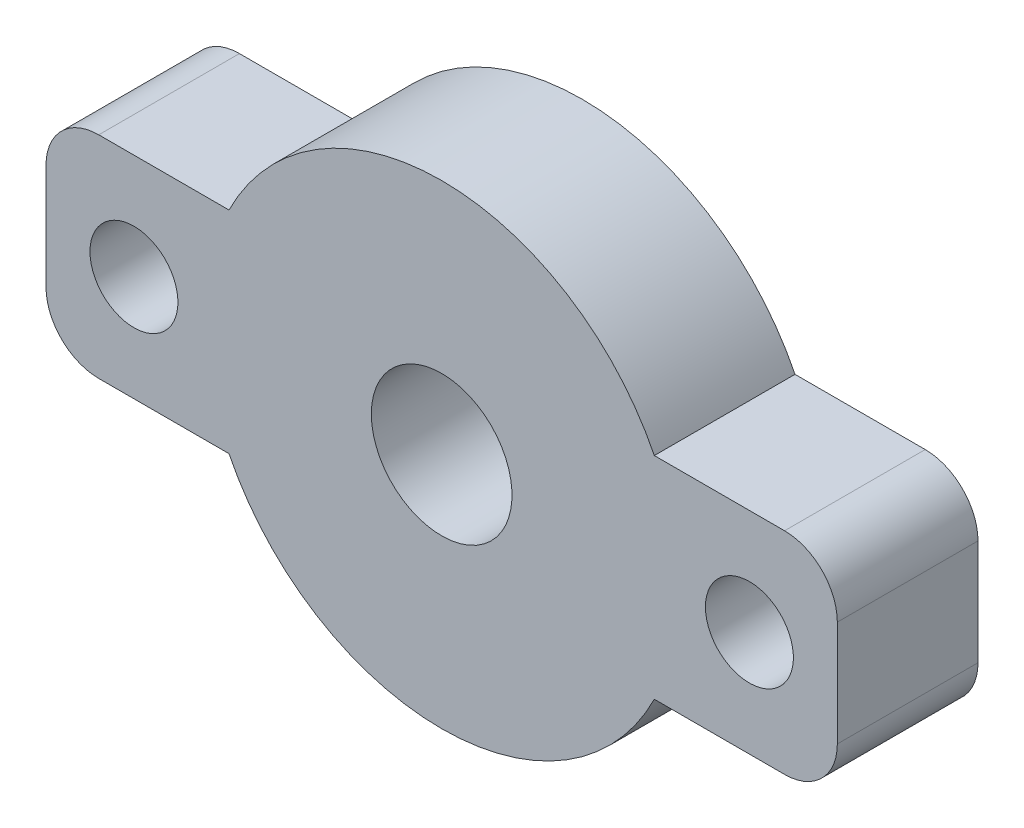
ISO-10303-21;
HEADER;
FILE_DESCRIPTION(('STEP AP214'),'2;1');
FILE_NAME('part.step','',(''),(''),'','','');
FILE_SCHEMA(('AUTOMOTIVE_DESIGN { 1 0 10303 214 1 1 1 1 }'));
ENDSEC;
DATA;
#1=APPLICATION_CONTEXT('core data for automotive mechanical design processes');
#2=APPLICATION_PROTOCOL_DEFINITION('international standard','automotive_design',2000,#1);
#3=PRODUCT_CONTEXT('',#1,'mechanical');
#4=PRODUCT('Part','Part','',(#3));
#5=PRODUCT_RELATED_PRODUCT_CATEGORY('part','',(#4));
#6=PRODUCT_DEFINITION_FORMATION('','',#4);
#7=PRODUCT_DEFINITION_CONTEXT('part definition',#1,'design');
#8=PRODUCT_DEFINITION('design','',#6,#7);
#9=PRODUCT_DEFINITION_SHAPE('','',#8);
#10=(LENGTH_UNIT() NAMED_UNIT(*) SI_UNIT(.MILLI.,.METRE.));
#11=(NAMED_UNIT(*) PLANE_ANGLE_UNIT() SI_UNIT($,.RADIAN.));
#12=(NAMED_UNIT(*) SI_UNIT($,.STERADIAN.) SOLID_ANGLE_UNIT());
#13=UNCERTAINTY_MEASURE_WITH_UNIT(LENGTH_MEASURE(1.E-05),#10,'distance_accuracy_value','');
#14=(GEOMETRIC_REPRESENTATION_CONTEXT(3) GLOBAL_UNCERTAINTY_ASSIGNED_CONTEXT((#13)) GLOBAL_UNIT_ASSIGNED_CONTEXT((#10,
#11,#12)) REPRESENTATION_CONTEXT('',''));
#15=CARTESIAN_POINT('',(0.,0.,0.));
#16=DIRECTION('',(0.,0.,1.));
#17=DIRECTION('',(1.,0.,0.));
#18=AXIS2_PLACEMENT_3D('',#15,#16,#17);
#19=CARTESIAN_POINT('',(0.,0.,8.));
#20=DIRECTION('',(0.,0.,-1.));
#21=DIRECTION('',(-1.,0.,0.));
#22=AXIS2_PLACEMENT_3D('',#19,#20,#21);
#23=CYLINDRICAL_SURFACE('',#22,13.5);
#24=CARTESIAN_POINT('',(0.,0.,8.));
#25=DIRECTION('',(0.,0.,1.));
#26=DIRECTION('',(1.,0.,0.));
#27=AXIS2_PLACEMENT_3D('',#24,#25,#26);
#28=CIRCLE('',#27,13.5);
#29=CARTESIAN_POINT('',(12.0933866224478,6.,8.));
#30=VERTEX_POINT('',#29);
#31=CARTESIAN_POINT('',(-12.0933866224478,6.,8.));
#32=VERTEX_POINT('',#31);
#33=EDGE_CURVE('E160',#30,#32,#28,.T.);
#34=ORIENTED_EDGE('',*,*,#33,.F.);
#35=DIRECTION('',(0.,0.,-1.));
#36=VECTOR('',#35,1.);
#37=CARTESIAN_POINT('',(12.0933866224478,6.,8.));
#38=LINE('',#37,#36);
#39=CARTESIAN_POINT('',(12.0933866224478,6.,0.));
#40=VERTEX_POINT('',#39);
#41=EDGE_CURVE('E131',#30,#40,#38,.T.);
#42=ORIENTED_EDGE('',*,*,#41,.T.);
#43=CARTESIAN_POINT('',(0.,0.,0.));
#44=DIRECTION('',(0.,0.,1.));
#45=DIRECTION('',(1.,0.,0.));
#46=AXIS2_PLACEMENT_3D('',#43,#44,#45);
#47=CIRCLE('',#46,13.5);
#48=CARTESIAN_POINT('',(-12.0933866224478,6.,0.));
#49=VERTEX_POINT('',#48);
#50=EDGE_CURVE('E130',#40,#49,#47,.T.);
#51=ORIENTED_EDGE('',*,*,#50,.T.);
#52=DIRECTION('',(0.,0.,-1.));
#53=VECTOR('',#52,1.);
#54=CARTESIAN_POINT('',(-12.0933866224478,6.,8.));
#55=LINE('',#54,#53);
#56=EDGE_CURVE('E141',#49,#32,#55,.F.);
#57=ORIENTED_EDGE('',*,*,#56,.T.);
#58=EDGE_LOOP('',(#34,#42,#51,#57));
#59=FACE_BOUND('',#58,.T.);
#60=ADVANCED_FACE('F33',(#59),#23,.T.);
#61=CARTESIAN_POINT('',(-12.0933866224478,-6.,8.));
#62=VERTEX_POINT('',#61);
#63=CARTESIAN_POINT('',(12.0933866224478,-6.,8.));
#64=VERTEX_POINT('',#63);
#65=EDGE_CURVE('E138',#62,#64,#28,.T.);
#66=ORIENTED_EDGE('',*,*,#65,.F.);
#67=DIRECTION('',(0.,0.,-1.));
#68=VECTOR('',#67,1.);
#69=CARTESIAN_POINT('',(-12.0933866224478,-6.,8.));
#70=LINE('',#69,#68);
#71=CARTESIAN_POINT('',(-12.0933866224478,-6.,0.));
#72=VERTEX_POINT('',#71);
#73=EDGE_CURVE('E135',#62,#72,#70,.T.);
#74=ORIENTED_EDGE('',*,*,#73,.T.);
#75=CARTESIAN_POINT('',(12.0933866224478,-6.,0.));
#76=VERTEX_POINT('',#75);
#77=EDGE_CURVE('E121',#72,#76,#47,.T.);
#78=ORIENTED_EDGE('',*,*,#77,.T.);
#79=DIRECTION('',(0.,0.,-1.));
#80=VECTOR('',#79,1.);
#81=CARTESIAN_POINT('',(12.0933866224478,-6.,8.));
#82=LINE('',#81,#80);
#83=EDGE_CURVE('E142',#76,#64,#82,.F.);
#84=ORIENTED_EDGE('',*,*,#83,.T.);
#85=EDGE_LOOP('',(#66,#74,#78,#84));
#86=FACE_BOUND('',#85,.T.);
#87=ADVANCED_FACE('F136',(#86),#23,.T.);
#88=CARTESIAN_POINT('',(0.,0.,8.));
#89=DIRECTION('',(0.,0.,1.));
#90=DIRECTION('',(1.,0.,0.));
#91=AXIS2_PLACEMENT_3D('',#88,#89,#90);
#92=PLANE('',#91);
#93=CARTESIAN_POINT('',(17.5,0.,8.));
#94=DIRECTION('',(0.,0.,-1.));
#95=DIRECTION('',(-1.,0.,0.));
#96=AXIS2_PLACEMENT_3D('',#93,#94,#95);
#97=CIRCLE('',#96,2.5);
#98=CARTESIAN_POINT('',(15.,0.,8.));
#99=VERTEX_POINT('',#98);
#100=EDGE_CURVE('E220',#99,#99,#97,.T.);
#101=ORIENTED_EDGE('',*,*,#100,.T.);
#102=EDGE_LOOP('',(#101));
#103=FACE_BOUND('',#102,.T.);
#104=CARTESIAN_POINT('',(-17.5,0.,8.));
#105=DIRECTION('',(0.,0.,-1.));
#106=DIRECTION('',(-1.,0.,0.));
#107=AXIS2_PLACEMENT_3D('',#104,#105,#106);
#108=CIRCLE('',#107,2.5);
#109=CARTESIAN_POINT('',(-20.,0.,8.));
#110=VERTEX_POINT('',#109);
#111=EDGE_CURVE('E226',#110,#110,#108,.T.);
#112=ORIENTED_EDGE('',*,*,#111,.T.);
#113=EDGE_LOOP('',(#112));
#114=FACE_BOUND('',#113,.T.);
#115=CARTESIAN_POINT('',(0.,0.,8.));
#116=DIRECTION('',(0.,0.,-1.));
#117=DIRECTION('',(-1.,0.,0.));
#118=AXIS2_PLACEMENT_3D('',#115,#116,#117);
#119=CIRCLE('',#118,4.);
#120=CARTESIAN_POINT('',(-4.,0.,8.));
#121=VERTEX_POINT('',#120);
#122=EDGE_CURVE('E212',#121,#121,#119,.T.);
#123=ORIENTED_EDGE('',*,*,#122,.T.);
#124=EDGE_LOOP('',(#123));
#125=FACE_BOUND('',#124,.T.);
#126=DIRECTION('',(0.,-1.,0.));
#127=VECTOR('',#126,1.);
#128=CARTESIAN_POINT('',(-22.5,-6.,8.));
#129=LINE('',#128,#127);
#130=CARTESIAN_POINT('',(-22.5,3.,8.));
#131=VERTEX_POINT('',#130);
#132=CARTESIAN_POINT('',(-22.5,-3.,8.));
#133=VERTEX_POINT('',#132);
#134=EDGE_CURVE('E211',#131,#133,#129,.T.);
#135=ORIENTED_EDGE('',*,*,#134,.T.);
#136=CARTESIAN_POINT('',(-19.5,-3.,8.));
#137=DIRECTION('',(0.,0.,1.));
#138=DIRECTION('',(1.,0.,0.));
#139=AXIS2_PLACEMENT_3D('',#136,#137,#138);
#140=CIRCLE('',#139,3.);
#141=CARTESIAN_POINT('',(-19.5,-6.,8.));
#142=VERTEX_POINT('',#141);
#143=EDGE_CURVE('E175',#133,#142,#140,.T.);
#144=ORIENTED_EDGE('',*,*,#143,.T.);
#145=DIRECTION('',(1.,0.,0.));
#146=VECTOR('',#145,1.);
#147=CARTESIAN_POINT('',(22.5,-6.,8.));
#148=LINE('',#147,#146);
#149=EDGE_CURVE('E206',#142,#62,#148,.T.);
#150=ORIENTED_EDGE('',*,*,#149,.T.);
#151=ORIENTED_EDGE('',*,*,#65,.T.);
#152=CARTESIAN_POINT('',(19.5,-6.,8.));
#153=VERTEX_POINT('',#152);
#154=EDGE_CURVE('E208',#64,#153,#148,.T.);
#155=ORIENTED_EDGE('',*,*,#154,.T.);
#156=CARTESIAN_POINT('',(19.5,-3.,8.));
#157=DIRECTION('',(0.,0.,1.));
#158=DIRECTION('',(1.,0.,0.));
#159=AXIS2_PLACEMENT_3D('',#156,#157,#158);
#160=CIRCLE('',#159,3.);
#161=CARTESIAN_POINT('',(22.5,-3.,8.));
#162=VERTEX_POINT('',#161);
#163=EDGE_CURVE('E171',#153,#162,#160,.T.);
#164=ORIENTED_EDGE('',*,*,#163,.T.);
#165=DIRECTION('',(0.,1.,0.));
#166=VECTOR('',#165,1.);
#167=CARTESIAN_POINT('',(22.5,-6.,8.));
#168=LINE('',#167,#166);
#169=CARTESIAN_POINT('',(22.5,3.,8.));
#170=VERTEX_POINT('',#169);
#171=EDGE_CURVE('E196',#162,#170,#168,.T.);
#172=ORIENTED_EDGE('',*,*,#171,.T.);
#173=CARTESIAN_POINT('',(19.5,3.,8.));
#174=DIRECTION('',(0.,0.,1.));
#175=DIRECTION('',(1.,0.,0.));
#176=AXIS2_PLACEMENT_3D('',#173,#174,#175);
#177=CIRCLE('',#176,3.);
#178=CARTESIAN_POINT('',(19.5,6.,8.));
#179=VERTEX_POINT('',#178);
#180=EDGE_CURVE('E169',#170,#179,#177,.T.);
#181=ORIENTED_EDGE('',*,*,#180,.T.);
#182=DIRECTION('',(-1.,0.,0.));
#183=VECTOR('',#182,1.);
#184=CARTESIAN_POINT('',(22.5,6.,8.));
#185=LINE('',#184,#183);
#186=EDGE_CURVE('E154',#179,#30,#185,.T.);
#187=ORIENTED_EDGE('',*,*,#186,.T.);
#188=ORIENTED_EDGE('',*,*,#33,.T.);
#189=CARTESIAN_POINT('',(-19.5,6.,8.));
#190=VERTEX_POINT('',#189);
#191=EDGE_CURVE('E205',#32,#190,#185,.T.);
#192=ORIENTED_EDGE('',*,*,#191,.T.);
#193=CARTESIAN_POINT('',(-19.5,3.,8.));
#194=DIRECTION('',(0.,0.,1.));
#195=DIRECTION('',(1.,0.,0.));
#196=AXIS2_PLACEMENT_3D('',#193,#194,#195);
#197=CIRCLE('',#196,3.);
#198=EDGE_CURVE('E173',#190,#131,#197,.T.);
#199=ORIENTED_EDGE('',*,*,#198,.T.);
#200=EDGE_LOOP('',(#135,#144,#150,#151,#155,#164,#172,#181,#187,#188,#192,#199));
#201=FACE_BOUND('',#200,.T.);
#202=ADVANCED_FACE('F202',(#103,#114,#125,#201),#92,.T.);
#203=CARTESIAN_POINT('',(0.,0.,0.));
#204=DIRECTION('',(0.,0.,1.));
#205=DIRECTION('',(1.,0.,0.));
#206=AXIS2_PLACEMENT_3D('',#203,#204,#205);
#207=PLANE('',#206);
#208=CARTESIAN_POINT('',(17.5,0.,0.));
#209=DIRECTION('',(0.,0.,-1.));
#210=DIRECTION('',(-1.,0.,0.));
#211=AXIS2_PLACEMENT_3D('',#208,#209,#210);
#212=CIRCLE('',#211,2.5);
#213=CARTESIAN_POINT('',(15.,0.,0.));
#214=VERTEX_POINT('',#213);
#215=EDGE_CURVE('E229',#214,#214,#212,.T.);
#216=ORIENTED_EDGE('',*,*,#215,.F.);
#217=EDGE_LOOP('',(#216));
#218=FACE_BOUND('',#217,.T.);
#219=CARTESIAN_POINT('',(-17.5,0.,0.));
#220=DIRECTION('',(0.,0.,-1.));
#221=DIRECTION('',(-1.,0.,0.));
#222=AXIS2_PLACEMENT_3D('',#219,#220,#221);
#223=CIRCLE('',#222,2.5);
#224=CARTESIAN_POINT('',(-20.,0.,0.));
#225=VERTEX_POINT('',#224);
#226=EDGE_CURVE('E223',#225,#225,#223,.T.);
#227=ORIENTED_EDGE('',*,*,#226,.F.);
#228=EDGE_LOOP('',(#227));
#229=FACE_BOUND('',#228,.T.);
#230=CARTESIAN_POINT('',(0.,0.,0.));
#231=DIRECTION('',(0.,0.,-1.));
#232=DIRECTION('',(-1.,0.,0.));
#233=AXIS2_PLACEMENT_3D('',#230,#231,#232);
#234=CIRCLE('',#233,4.);
#235=CARTESIAN_POINT('',(-4.,0.,0.));
#236=VERTEX_POINT('',#235);
#237=EDGE_CURVE('E217',#236,#236,#234,.T.);
#238=ORIENTED_EDGE('',*,*,#237,.F.);
#239=EDGE_LOOP('',(#238));
#240=FACE_BOUND('',#239,.T.);
#241=DIRECTION('',(-1.,0.,0.));
#242=VECTOR('',#241,1.);
#243=CARTESIAN_POINT('',(22.5,-6.,0.));
#244=LINE('',#243,#242);
#245=CARTESIAN_POINT('',(-19.5,-6.,0.));
#246=VERTEX_POINT('',#245);
#247=EDGE_CURVE('E125',#72,#246,#244,.T.);
#248=ORIENTED_EDGE('',*,*,#247,.T.);
#249=CARTESIAN_POINT('',(-19.5,-3.,0.));
#250=DIRECTION('',(0.,0.,1.));
#251=DIRECTION('',(1.,0.,0.));
#252=AXIS2_PLACEMENT_3D('',#249,#250,#251);
#253=CIRCLE('',#252,3.);
#254=CARTESIAN_POINT('',(-22.5,-3.,0.));
#255=VERTEX_POINT('',#254);
#256=EDGE_CURVE('E183',#246,#255,#253,.F.);
#257=ORIENTED_EDGE('',*,*,#256,.T.);
#258=DIRECTION('',(0.,1.,0.));
#259=VECTOR('',#258,1.);
#260=CARTESIAN_POINT('',(-22.5,-6.,0.));
#261=LINE('',#260,#259);
#262=CARTESIAN_POINT('',(-22.5,3.,0.));
#263=VERTEX_POINT('',#262);
#264=EDGE_CURVE('E147',#255,#263,#261,.T.);
#265=ORIENTED_EDGE('',*,*,#264,.T.);
#266=CARTESIAN_POINT('',(-19.5,3.,0.));
#267=DIRECTION('',(0.,0.,1.));
#268=DIRECTION('',(1.,0.,0.));
#269=AXIS2_PLACEMENT_3D('',#266,#267,#268);
#270=CIRCLE('',#269,3.);
#271=CARTESIAN_POINT('',(-19.5,6.,0.));
#272=VERTEX_POINT('',#271);
#273=EDGE_CURVE('E181',#263,#272,#270,.F.);
#274=ORIENTED_EDGE('',*,*,#273,.T.);
#275=DIRECTION('',(1.,0.,0.));
#276=VECTOR('',#275,1.);
#277=CARTESIAN_POINT('',(22.5,6.,0.));
#278=LINE('',#277,#276);
#279=EDGE_CURVE('E150',#272,#49,#278,.T.);
#280=ORIENTED_EDGE('',*,*,#279,.T.);
#281=ORIENTED_EDGE('',*,*,#50,.F.);
#282=CARTESIAN_POINT('',(19.5,6.,0.));
#283=VERTEX_POINT('',#282);
#284=EDGE_CURVE('E215',#40,#283,#278,.T.);
#285=ORIENTED_EDGE('',*,*,#284,.T.);
#286=CARTESIAN_POINT('',(19.5,3.,0.));
#287=DIRECTION('',(0.,0.,1.));
#288=DIRECTION('',(1.,0.,0.));
#289=AXIS2_PLACEMENT_3D('',#286,#287,#288);
#290=CIRCLE('',#289,3.);
#291=CARTESIAN_POINT('',(22.5,3.,0.));
#292=VERTEX_POINT('',#291);
#293=EDGE_CURVE('E178',#283,#292,#290,.F.);
#294=ORIENTED_EDGE('',*,*,#293,.T.);
#295=DIRECTION('',(0.,-1.,0.));
#296=VECTOR('',#295,1.);
#297=CARTESIAN_POINT('',(22.5,-6.,0.));
#298=LINE('',#297,#296);
#299=CARTESIAN_POINT('',(22.5,-3.,0.));
#300=VERTEX_POINT('',#299);
#301=EDGE_CURVE('E197',#292,#300,#298,.T.);
#302=ORIENTED_EDGE('',*,*,#301,.T.);
#303=CARTESIAN_POINT('',(19.5,-3.,0.));
#304=DIRECTION('',(0.,0.,1.));
#305=DIRECTION('',(1.,0.,0.));
#306=AXIS2_PLACEMENT_3D('',#303,#304,#305);
#307=CIRCLE('',#306,3.);
#308=CARTESIAN_POINT('',(19.5,-6.,0.));
#309=VERTEX_POINT('',#308);
#310=EDGE_CURVE('E48',#300,#309,#307,.F.);
#311=ORIENTED_EDGE('',*,*,#310,.T.);
#312=EDGE_CURVE('E127',#309,#76,#244,.T.);
#313=ORIENTED_EDGE('',*,*,#312,.T.);
#314=ORIENTED_EDGE('',*,*,#77,.F.);
#315=EDGE_LOOP('',(#248,#257,#265,#274,#280,#281,#285,#294,#302,#311,#313,#314));
#316=FACE_BOUND('',#315,.T.);
#317=ADVANCED_FACE('F123',(#218,#229,#240,#316),#207,.F.);
#318=CARTESIAN_POINT('',(22.5,-6.,-46.5725240887801));
#319=DIRECTION('',(1.,0.,0.));
#320=DIRECTION('',(0.,0.,-1.));
#321=AXIS2_PLACEMENT_3D('',#318,#319,#320);
#322=PLANE('',#321);
#323=ORIENTED_EDGE('',*,*,#171,.F.);
#324=DIRECTION('',(0.,0.,1.));
#325=VECTOR('',#324,1.);
#326=CARTESIAN_POINT('',(22.5,-3.,-46.5725240887801));
#327=LINE('',#326,#325);
#328=EDGE_CURVE('E41',#162,#300,#327,.F.);
#329=ORIENTED_EDGE('',*,*,#328,.T.);
#330=ORIENTED_EDGE('',*,*,#301,.F.);
#331=DIRECTION('',(0.,0.,1.));
#332=VECTOR('',#331,1.);
#333=CARTESIAN_POINT('',(22.5,3.,-46.5725240887801));
#334=LINE('',#333,#332);
#335=EDGE_CURVE('E191',#292,#170,#334,.T.);
#336=ORIENTED_EDGE('',*,*,#335,.T.);
#337=EDGE_LOOP('',(#323,#329,#330,#336));
#338=FACE_BOUND('',#337,.T.);
#339=ADVANCED_FACE('F195',(#338),#322,.T.);
#340=CARTESIAN_POINT('',(22.5,-6.,-46.5725240887801));
#341=DIRECTION('',(0.,-1.,0.));
#342=DIRECTION('',(1.,0.,0.));
#343=AXIS2_PLACEMENT_3D('',#340,#341,#342);
#344=PLANE('',#343);
#345=ORIENTED_EDGE('',*,*,#312,.F.);
#346=DIRECTION('',(0.,0.,1.));
#347=VECTOR('',#346,1.);
#348=CARTESIAN_POINT('',(19.5,-6.,-46.5725240887801));
#349=LINE('',#348,#347);
#350=EDGE_CURVE('E188',#309,#153,#349,.T.);
#351=ORIENTED_EDGE('',*,*,#350,.T.);
#352=ORIENTED_EDGE('',*,*,#154,.F.);
#353=ORIENTED_EDGE('',*,*,#83,.F.);
#354=EDGE_LOOP('',(#345,#351,#352,#353));
#355=FACE_BOUND('',#354,.T.);
#356=ADVANCED_FACE('F291',(#355),#344,.T.);
#357=CARTESIAN_POINT('',(22.5,6.,-46.5725240887801));
#358=DIRECTION('',(0.,1.,0.));
#359=DIRECTION('',(-1.,0.,0.));
#360=AXIS2_PLACEMENT_3D('',#357,#358,#359);
#361=PLANE('',#360);
#362=ORIENTED_EDGE('',*,*,#186,.F.);
#363=DIRECTION('',(0.,0.,1.));
#364=VECTOR('',#363,1.);
#365=CARTESIAN_POINT('',(19.5,6.,-46.5725240887801));
#366=LINE('',#365,#364);
#367=EDGE_CURVE('E11',#179,#283,#366,.F.);
#368=ORIENTED_EDGE('',*,*,#367,.T.);
#369=ORIENTED_EDGE('',*,*,#284,.F.);
#370=ORIENTED_EDGE('',*,*,#41,.F.);
#371=EDGE_LOOP('',(#362,#368,#369,#370));
#372=FACE_BOUND('',#371,.T.);
#373=ADVANCED_FACE('F306',(#372),#361,.T.);
#374=ORIENTED_EDGE('',*,*,#279,.F.);
#375=DIRECTION('',(0.,0.,1.));
#376=VECTOR('',#375,1.);
#377=CARTESIAN_POINT('',(-19.5,6.,-46.5725240887801));
#378=LINE('',#377,#376);
#379=EDGE_CURVE('E185',#272,#190,#378,.T.);
#380=ORIENTED_EDGE('',*,*,#379,.T.);
#381=ORIENTED_EDGE('',*,*,#191,.F.);
#382=ORIENTED_EDGE('',*,*,#56,.F.);
#383=EDGE_LOOP('',(#374,#380,#381,#382));
#384=FACE_BOUND('',#383,.T.);
#385=ADVANCED_FACE('F301',(#384),#361,.T.);
#386=ORIENTED_EDGE('',*,*,#149,.F.);
#387=DIRECTION('',(0.,0.,1.));
#388=VECTOR('',#387,1.);
#389=CARTESIAN_POINT('',(-19.5,-6.,-46.5725240887801));
#390=LINE('',#389,#388);
#391=EDGE_CURVE('E146',#142,#246,#390,.F.);
#392=ORIENTED_EDGE('',*,*,#391,.T.);
#393=ORIENTED_EDGE('',*,*,#247,.F.);
#394=ORIENTED_EDGE('',*,*,#73,.F.);
#395=EDGE_LOOP('',(#386,#392,#393,#394));
#396=FACE_BOUND('',#395,.T.);
#397=ADVANCED_FACE('F144',(#396),#344,.T.);
#398=CARTESIAN_POINT('',(-22.5,-6.,-46.5725240887801));
#399=DIRECTION('',(-1.,0.,0.));
#400=DIRECTION('',(0.,0.,1.));
#401=AXIS2_PLACEMENT_3D('',#398,#399,#400);
#402=PLANE('',#401);
#403=ORIENTED_EDGE('',*,*,#264,.F.);
#404=DIRECTION('',(0.,0.,1.));
#405=VECTOR('',#404,1.);
#406=CARTESIAN_POINT('',(-22.5,-3.,-46.5725240887801));
#407=LINE('',#406,#405);
#408=EDGE_CURVE('E166',#255,#133,#407,.T.);
#409=ORIENTED_EDGE('',*,*,#408,.T.);
#410=ORIENTED_EDGE('',*,*,#134,.F.);
#411=DIRECTION('',(0.,0.,1.));
#412=VECTOR('',#411,1.);
#413=CARTESIAN_POINT('',(-22.5,3.,-46.5725240887801));
#414=LINE('',#413,#412);
#415=EDGE_CURVE('E162',#131,#263,#414,.F.);
#416=ORIENTED_EDGE('',*,*,#415,.T.);
#417=EDGE_LOOP('',(#403,#409,#410,#416));
#418=FACE_BOUND('',#417,.T.);
#419=ADVANCED_FACE('F254',(#418),#402,.T.);
#420=CARTESIAN_POINT('',(0.,0.,8.));
#421=DIRECTION('',(0.,0.,-1.));
#422=DIRECTION('',(-1.,0.,0.));
#423=AXIS2_PLACEMENT_3D('',#420,#421,#422);
#424=CYLINDRICAL_SURFACE('',#423,4.);
#425=ORIENTED_EDGE('',*,*,#122,.F.);
#426=EDGE_LOOP('',(#425));
#427=FACE_BOUND('',#426,.T.);
#428=ORIENTED_EDGE('',*,*,#237,.T.);
#429=EDGE_LOOP('',(#428));
#430=FACE_BOUND('',#429,.T.);
#431=ADVANCED_FACE('F252',(#427,#430),#424,.F.);
#432=CARTESIAN_POINT('',(-17.5,0.,8.));
#433=DIRECTION('',(0.,0.,-1.));
#434=DIRECTION('',(-1.,0.,0.));
#435=AXIS2_PLACEMENT_3D('',#432,#433,#434);
#436=CYLINDRICAL_SURFACE('',#435,2.5);
#437=ORIENTED_EDGE('',*,*,#111,.F.);
#438=EDGE_LOOP('',(#437));
#439=FACE_BOUND('',#438,.T.);
#440=ORIENTED_EDGE('',*,*,#226,.T.);
#441=EDGE_LOOP('',(#440));
#442=FACE_BOUND('',#441,.T.);
#443=ADVANCED_FACE('F241',(#439,#442),#436,.F.);
#444=CARTESIAN_POINT('',(17.5,0.,8.));
#445=DIRECTION('',(0.,0.,-1.));
#446=DIRECTION('',(-1.,0.,0.));
#447=AXIS2_PLACEMENT_3D('',#444,#445,#446);
#448=CYLINDRICAL_SURFACE('',#447,2.5);
#449=ORIENTED_EDGE('',*,*,#100,.F.);
#450=EDGE_LOOP('',(#449));
#451=FACE_BOUND('',#450,.T.);
#452=ORIENTED_EDGE('',*,*,#215,.T.);
#453=EDGE_LOOP('',(#452));
#454=FACE_BOUND('',#453,.T.);
#455=ADVANCED_FACE('F237',(#451,#454),#448,.F.);
#456=CARTESIAN_POINT('',(-19.5,-3.,-46.5725240887801));
#457=DIRECTION('',(0.,0.,1.));
#458=DIRECTION('',(1.,0.,0.));
#459=AXIS2_PLACEMENT_3D('',#456,#457,#458);
#460=CYLINDRICAL_SURFACE('',#459,3.);
#461=ORIENTED_EDGE('',*,*,#256,.F.);
#462=ORIENTED_EDGE('',*,*,#391,.F.);
#463=ORIENTED_EDGE('',*,*,#143,.F.);
#464=ORIENTED_EDGE('',*,*,#408,.F.);
#465=EDGE_LOOP('',(#461,#462,#463,#464));
#466=FACE_BOUND('',#465,.T.);
#467=ADVANCED_FACE('F240',(#466),#460,.T.);
#468=CARTESIAN_POINT('',(-19.5,3.,-46.5725240887801));
#469=DIRECTION('',(0.,0.,1.));
#470=DIRECTION('',(1.,0.,0.));
#471=AXIS2_PLACEMENT_3D('',#468,#469,#470);
#472=CYLINDRICAL_SURFACE('',#471,3.);
#473=ORIENTED_EDGE('',*,*,#273,.F.);
#474=ORIENTED_EDGE('',*,*,#415,.F.);
#475=ORIENTED_EDGE('',*,*,#198,.F.);
#476=ORIENTED_EDGE('',*,*,#379,.F.);
#477=EDGE_LOOP('',(#473,#474,#475,#476));
#478=FACE_BOUND('',#477,.T.);
#479=ADVANCED_FACE('F278',(#478),#472,.T.);
#480=CARTESIAN_POINT('',(19.5,-3.,-46.5725240887801));
#481=DIRECTION('',(0.,0.,1.));
#482=DIRECTION('',(1.,0.,0.));
#483=AXIS2_PLACEMENT_3D('',#480,#481,#482);
#484=CYLINDRICAL_SURFACE('',#483,3.);
#485=ORIENTED_EDGE('',*,*,#310,.F.);
#486=ORIENTED_EDGE('',*,*,#328,.F.);
#487=ORIENTED_EDGE('',*,*,#163,.F.);
#488=ORIENTED_EDGE('',*,*,#350,.F.);
#489=EDGE_LOOP('',(#485,#486,#487,#488));
#490=FACE_BOUND('',#489,.T.);
#491=ADVANCED_FACE('F281',(#490),#484,.T.);
#492=CARTESIAN_POINT('',(19.5,3.,-46.5725240887801));
#493=DIRECTION('',(0.,0.,1.));
#494=DIRECTION('',(1.,0.,0.));
#495=AXIS2_PLACEMENT_3D('',#492,#493,#494);
#496=CYLINDRICAL_SURFACE('',#495,3.);
#497=ORIENTED_EDGE('',*,*,#293,.F.);
#498=ORIENTED_EDGE('',*,*,#367,.F.);
#499=ORIENTED_EDGE('',*,*,#180,.F.);
#500=ORIENTED_EDGE('',*,*,#335,.F.);
#501=EDGE_LOOP('',(#497,#498,#499,#500));
#502=FACE_BOUND('',#501,.T.);
#503=ADVANCED_FACE('F35',(#502),#496,.T.);
#504=CLOSED_SHELL('',(#60,#87,#202,#317,#339,#356,#373,#385,#397,#419,#431,#443,#455,#467,#479,
#491,#503));
#505=MANIFOLD_SOLID_BREP('B2',#504);
#506=ADVANCED_BREP_SHAPE_REPRESENTATION('',(#18,#505),#14);
#507=SHAPE_DEFINITION_REPRESENTATION(#9,#506);
ENDSEC;
END-ISO-10303-21;
